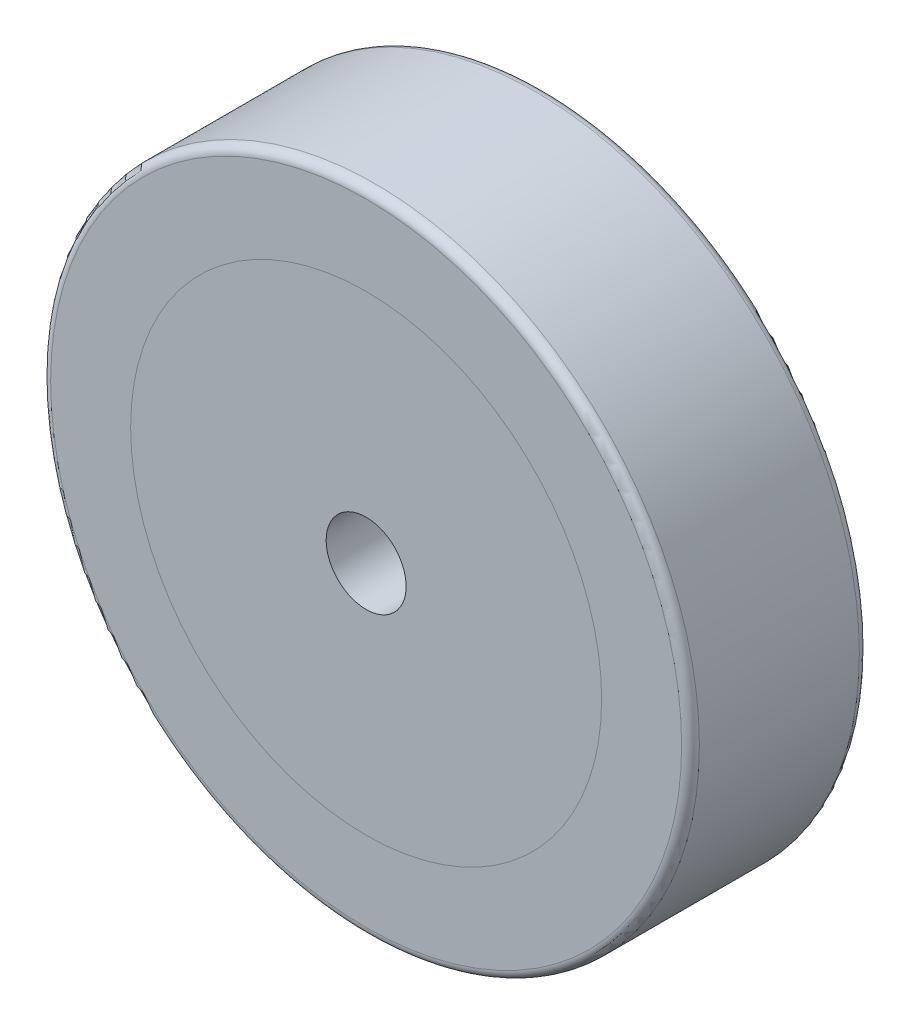
ISO-10303-21;
HEADER;
FILE_DESCRIPTION(('STEP AP214'),'2;1');
FILE_NAME('part.step','',(''),(''),'','','');
FILE_SCHEMA(('AUTOMOTIVE_DESIGN { 1 0 10303 214 1 1 1 1 }'));
ENDSEC;
DATA;
#1=APPLICATION_CONTEXT('core data for automotive mechanical design processes');
#2=APPLICATION_PROTOCOL_DEFINITION('international standard','automotive_design',2000,#1);
#3=PRODUCT_CONTEXT('',#1,'mechanical');
#4=PRODUCT('Part','Part','',(#3));
#5=PRODUCT_RELATED_PRODUCT_CATEGORY('part','',(#4));
#6=PRODUCT_DEFINITION_FORMATION('','',#4);
#7=PRODUCT_DEFINITION_CONTEXT('part definition',#1,'design');
#8=PRODUCT_DEFINITION('design','',#6,#7);
#9=PRODUCT_DEFINITION_SHAPE('','',#8);
#10=(LENGTH_UNIT() NAMED_UNIT(*) SI_UNIT(.MILLI.,.METRE.));
#11=(NAMED_UNIT(*) PLANE_ANGLE_UNIT() SI_UNIT($,.RADIAN.));
#12=(NAMED_UNIT(*) SI_UNIT($,.STERADIAN.) SOLID_ANGLE_UNIT());
#13=UNCERTAINTY_MEASURE_WITH_UNIT(LENGTH_MEASURE(1.E-05),#10,'distance_accuracy_value','');
#14=(GEOMETRIC_REPRESENTATION_CONTEXT(3) GLOBAL_UNCERTAINTY_ASSIGNED_CONTEXT((#13)) GLOBAL_UNIT_ASSIGNED_CONTEXT((#10,
#11,#12)) REPRESENTATION_CONTEXT('',''));
#15=CARTESIAN_POINT('',(0.,0.,0.));
#16=DIRECTION('',(0.,0.,1.));
#17=DIRECTION('',(1.,0.,0.));
#18=AXIS2_PLACEMENT_3D('',#15,#16,#17);
#19=CARTESIAN_POINT('',(0.,0.,0.));
#20=DIRECTION('',(0.,0.,1.));
#21=DIRECTION('',(1.,0.,0.));
#22=AXIS2_PLACEMENT_3D('',#19,#20,#21);
#23=CYLINDRICAL_SURFACE('',#22,26.5);
#24=CARTESIAN_POINT('',(0.,0.,0.));
#25=DIRECTION('',(0.,0.,1.));
#26=DIRECTION('',(1.,0.,0.));
#27=AXIS2_PLACEMENT_3D('',#24,#25,#26);
#28=CIRCLE('',#27,26.5);
#29=CARTESIAN_POINT('',(26.5,0.,0.));
#30=VERTEX_POINT('',#29);
#31=EDGE_CURVE('E11',#30,#30,#28,.T.);
#32=ORIENTED_EDGE('',*,*,#31,.T.);
#33=EDGE_LOOP('',(#32));
#34=FACE_BOUND('',#33,.T.);
#35=CARTESIAN_POINT('',(0.,0.,20.));
#36=DIRECTION('',(0.,0.,1.));
#37=DIRECTION('',(1.,0.,0.));
#38=AXIS2_PLACEMENT_3D('',#35,#36,#37);
#39=CIRCLE('',#38,26.5);
#40=CARTESIAN_POINT('',(26.5,0.,20.));
#41=VERTEX_POINT('',#40);
#42=EDGE_CURVE('E39',#41,#41,#39,.T.);
#43=ORIENTED_EDGE('',*,*,#42,.F.);
#44=EDGE_LOOP('',(#43));
#45=FACE_BOUND('',#44,.T.);
#46=ADVANCED_FACE('F36',(#34,#45),#23,.T.);
#47=CARTESIAN_POINT('',(0.,0.,0.));
#48=DIRECTION('',(0.,0.,1.));
#49=DIRECTION('',(1.,0.,0.));
#50=AXIS2_PLACEMENT_3D('',#47,#48,#49);
#51=PLANE('',#50);
#52=CARTESIAN_POINT('',(0.,0.,0.));
#53=DIRECTION('',(0.,0.,-1.));
#54=DIRECTION('',(-1.,0.,0.));
#55=AXIS2_PLACEMENT_3D('',#52,#53,#54);
#56=CIRCLE('',#55,4.49999999999999);
#57=CARTESIAN_POINT('',(-4.49999999999999,0.,0.));
#58=VERTEX_POINT('',#57);
#59=EDGE_CURVE('E50',#58,#58,#56,.T.);
#60=ORIENTED_EDGE('',*,*,#59,.F.);
#61=EDGE_LOOP('',(#60));
#62=FACE_BOUND('',#61,.T.);
#63=ORIENTED_EDGE('',*,*,#31,.F.);
#64=EDGE_LOOP('',(#63));
#65=FACE_BOUND('',#64,.T.);
#66=ADVANCED_FACE('F56',(#62,#65),#51,.F.);
#67=CARTESIAN_POINT('',(0.,0.,20.));
#68=DIRECTION('',(0.,0.,1.));
#69=DIRECTION('',(1.,0.,0.));
#70=AXIS2_PLACEMENT_3D('',#67,#68,#69);
#71=PLANE('',#70);
#72=CARTESIAN_POINT('',(0.,0.,20.));
#73=DIRECTION('',(0.,0.,-1.));
#74=DIRECTION('',(-1.,0.,0.));
#75=AXIS2_PLACEMENT_3D('',#72,#73,#74);
#76=CIRCLE('',#75,4.49999999999999);
#77=CARTESIAN_POINT('',(-4.49999999999999,0.,20.));
#78=VERTEX_POINT('',#77);
#79=EDGE_CURVE('E46',#78,#78,#76,.T.);
#80=ORIENTED_EDGE('',*,*,#79,.T.);
#81=EDGE_LOOP('',(#80));
#82=FACE_BOUND('',#81,.T.);
#83=ORIENTED_EDGE('',*,*,#42,.T.);
#84=EDGE_LOOP('',(#83));
#85=FACE_BOUND('',#84,.T.);
#86=ADVANCED_FACE('F59',(#82,#85),#71,.T.);
#87=CARTESIAN_POINT('',(0.,0.,0.));
#88=DIRECTION('',(0.,0.,-1.));
#89=DIRECTION('',(-1.,0.,0.));
#90=AXIS2_PLACEMENT_3D('',#87,#88,#89);
#91=CYLINDRICAL_SURFACE('',#90,4.49999999999999);
#92=ORIENTED_EDGE('',*,*,#79,.F.);
#93=EDGE_LOOP('',(#92));
#94=FACE_BOUND('',#93,.T.);
#95=ORIENTED_EDGE('',*,*,#59,.T.);
#96=EDGE_LOOP('',(#95));
#97=FACE_BOUND('',#96,.T.);
#98=ADVANCED_FACE('F54',(#94,#97),#91,.F.);
#99=CLOSED_SHELL('',(#46,#66,#86,#98));
#100=MANIFOLD_SOLID_BREP('B2',#99);
#101=CARTESIAN_POINT('',(0.,0.,20.));
#102=DIRECTION('',(0.,0.,-1.));
#103=DIRECTION('',(-1.,0.,0.));
#104=AXIS2_PLACEMENT_3D('',#101,#102,#103);
#105=CYLINDRICAL_SURFACE('',#104,36.5);
#106=CARTESIAN_POINT('',(0.,0.,1.));
#107=DIRECTION('',(0.,0.,1.));
#108=DIRECTION('',(1.,0.,0.));
#109=AXIS2_PLACEMENT_3D('',#106,#107,#108);
#110=CIRCLE('',#109,36.5);
#111=CARTESIAN_POINT('',(36.5,0.,1.));
#112=VERTEX_POINT('',#111);
#113=EDGE_CURVE('E109',#112,#112,#110,.T.);
#114=ORIENTED_EDGE('',*,*,#113,.T.);
#115=EDGE_LOOP('',(#114));
#116=FACE_BOUND('',#115,.T.);
#117=CARTESIAN_POINT('',(0.,0.,19.));
#118=DIRECTION('',(0.,0.,1.));
#119=DIRECTION('',(1.,0.,0.));
#120=AXIS2_PLACEMENT_3D('',#117,#118,#119);
#121=CIRCLE('',#120,36.5);
#122=CARTESIAN_POINT('',(36.5,0.,19.));
#123=VERTEX_POINT('',#122);
#124=EDGE_CURVE('E113',#123,#123,#121,.F.);
#125=ORIENTED_EDGE('',*,*,#124,.T.);
#126=EDGE_LOOP('',(#125));
#127=FACE_BOUND('',#126,.T.);
#128=ADVANCED_FACE('F98',(#116,#127),#105,.T.);
#129=CARTESIAN_POINT('',(0.,0.,20.));
#130=DIRECTION('',(0.,0.,1.));
#131=DIRECTION('',(1.,0.,0.));
#132=AXIS2_PLACEMENT_3D('',#129,#130,#131);
#133=PLANE('',#132);
#134=CARTESIAN_POINT('',(0.,0.,20.));
#135=DIRECTION('',(0.,0.,1.));
#136=DIRECTION('',(1.,0.,0.));
#137=AXIS2_PLACEMENT_3D('',#134,#135,#136);
#138=CIRCLE('',#137,35.5);
#139=CARTESIAN_POINT('',(35.5,0.,20.));
#140=VERTEX_POINT('',#139);
#141=EDGE_CURVE('E35',#140,#140,#138,.T.);
#142=ORIENTED_EDGE('',*,*,#141,.T.);
#143=EDGE_LOOP('',(#142));
#144=FACE_BOUND('',#143,.T.);
#145=CARTESIAN_POINT('',(0.,0.,20.));
#146=DIRECTION('',(0.,0.,1.));
#147=DIRECTION('',(1.,0.,0.));
#148=AXIS2_PLACEMENT_3D('',#145,#146,#147);
#149=CIRCLE('',#148,26.5);
#150=CARTESIAN_POINT('',(26.5,0.,20.));
#151=VERTEX_POINT('',#150);
#152=EDGE_CURVE('E119',#151,#151,#149,.T.);
#153=ORIENTED_EDGE('',*,*,#152,.F.);
#154=EDGE_LOOP('',(#153));
#155=FACE_BOUND('',#154,.T.);
#156=ADVANCED_FACE('F134',(#144,#155),#133,.T.);
#157=CARTESIAN_POINT('',(0.,0.,0.));
#158=DIRECTION('',(0.,0.,1.));
#159=DIRECTION('',(1.,0.,0.));
#160=AXIS2_PLACEMENT_3D('',#157,#158,#159);
#161=PLANE('',#160);
#162=CARTESIAN_POINT('',(0.,0.,0.));
#163=DIRECTION('',(0.,0.,1.));
#164=DIRECTION('',(1.,0.,0.));
#165=AXIS2_PLACEMENT_3D('',#162,#163,#164);
#166=CIRCLE('',#165,35.5);
#167=CARTESIAN_POINT('',(35.5,0.,0.));
#168=VERTEX_POINT('',#167);
#169=EDGE_CURVE('E105',#168,#168,#166,.F.);
#170=ORIENTED_EDGE('',*,*,#169,.T.);
#171=EDGE_LOOP('',(#170));
#172=FACE_BOUND('',#171,.T.);
#173=CARTESIAN_POINT('',(0.,0.,0.));
#174=DIRECTION('',(0.,0.,1.));
#175=DIRECTION('',(1.,0.,0.));
#176=AXIS2_PLACEMENT_3D('',#173,#174,#175);
#177=CIRCLE('',#176,26.5);
#178=CARTESIAN_POINT('',(26.5,0.,0.));
#179=VERTEX_POINT('',#178);
#180=EDGE_CURVE('E118',#179,#179,#177,.T.);
#181=ORIENTED_EDGE('',*,*,#180,.T.);
#182=EDGE_LOOP('',(#181));
#183=FACE_BOUND('',#182,.T.);
#184=ADVANCED_FACE('F125',(#172,#183),#161,.F.);
#185=CARTESIAN_POINT('',(0.,0.,0.));
#186=DIRECTION('',(0.,0.,1.));
#187=DIRECTION('',(1.,0.,0.));
#188=AXIS2_PLACEMENT_3D('',#185,#186,#187);
#189=CYLINDRICAL_SURFACE('',#188,26.5);
#190=ORIENTED_EDGE('',*,*,#180,.F.);
#191=EDGE_LOOP('',(#190));
#192=FACE_BOUND('',#191,.T.);
#193=ORIENTED_EDGE('',*,*,#152,.T.);
#194=EDGE_LOOP('',(#193));
#195=FACE_BOUND('',#194,.T.);
#196=ADVANCED_FACE('F127',(#192,#195),#189,.F.);
#197=CARTESIAN_POINT('',(0.,0.,1.));
#198=DIRECTION('',(0.,0.,1.));
#199=DIRECTION('',(1.,0.,0.));
#200=AXIS2_PLACEMENT_3D('',#197,#198,#199);
#201=TOROIDAL_SURFACE('',#200,35.5,1.);
#202=ORIENTED_EDGE('',*,*,#169,.F.);
#203=EDGE_LOOP('',(#202));
#204=FACE_BOUND('',#203,.T.);
#205=ORIENTED_EDGE('',*,*,#113,.F.);
#206=EDGE_LOOP('',(#205));
#207=FACE_BOUND('',#206,.T.);
#208=ADVANCED_FACE('F130',(#204,#207),#201,.T.);
#209=CARTESIAN_POINT('',(0.,0.,19.));
#210=DIRECTION('',(0.,0.,1.));
#211=DIRECTION('',(1.,0.,0.));
#212=AXIS2_PLACEMENT_3D('',#209,#210,#211);
#213=TOROIDAL_SURFACE('',#212,35.5,1.);
#214=ORIENTED_EDGE('',*,*,#124,.F.);
#215=EDGE_LOOP('',(#214));
#216=FACE_BOUND('',#215,.T.);
#217=ORIENTED_EDGE('',*,*,#141,.F.);
#218=EDGE_LOOP('',(#217));
#219=FACE_BOUND('',#218,.T.);
#220=ADVANCED_FACE('F100',(#216,#219),#213,.T.);
#221=CLOSED_SHELL('',(#128,#156,#184,#196,#208,#220));
#222=MANIFOLD_SOLID_BREP('B6',#221);
#223=ADVANCED_BREP_SHAPE_REPRESENTATION('',(#18,#100,#222),#14);
#224=SHAPE_DEFINITION_REPRESENTATION(#9,#223);
ENDSEC;
END-ISO-10303-21;
